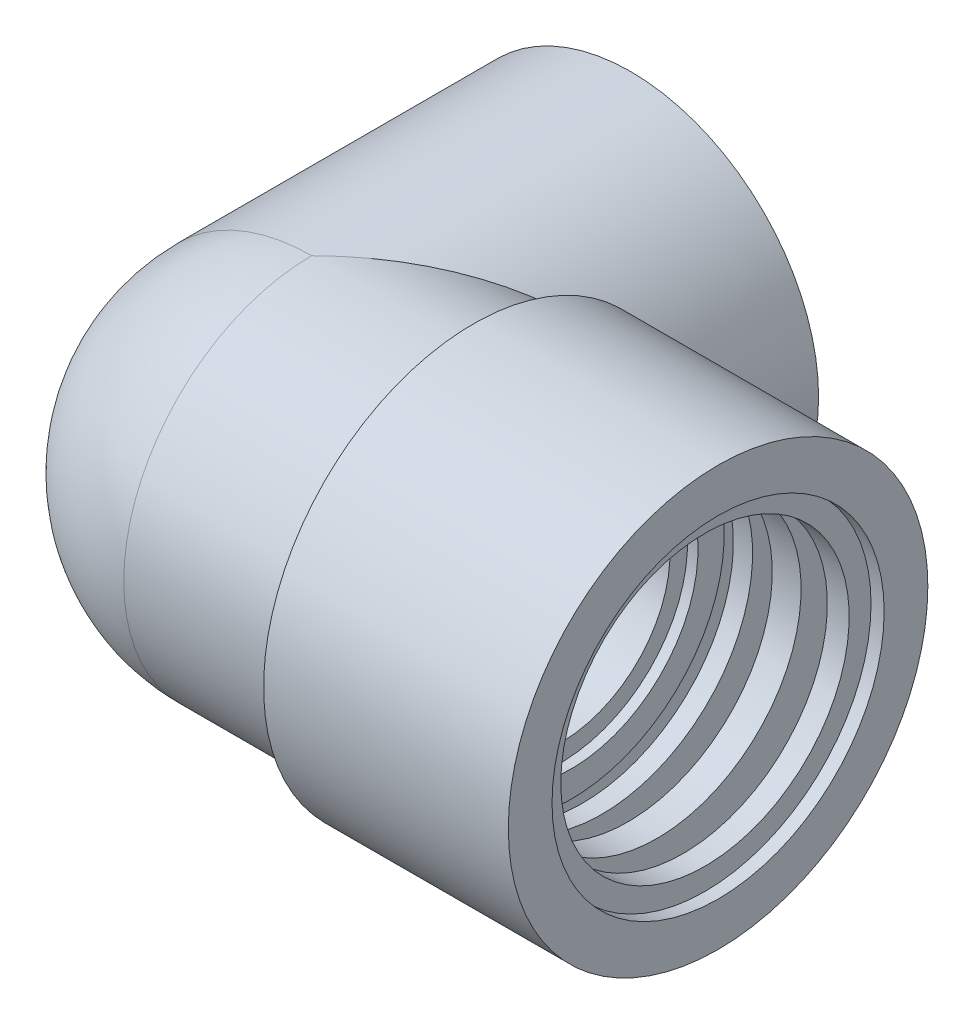
ISO-10303-21;
HEADER;
FILE_DESCRIPTION(('STEP AP214'),'2;1');
FILE_NAME('part.step','',(''),(''),'','','');
FILE_SCHEMA(('AUTOMOTIVE_DESIGN { 1 0 10303 214 1 1 1 1 }'));
ENDSEC;
DATA;
#1=APPLICATION_CONTEXT('core data for automotive mechanical design processes');
#2=APPLICATION_PROTOCOL_DEFINITION('international standard','automotive_design',2000,#1);
#3=PRODUCT_CONTEXT('',#1,'mechanical');
#4=PRODUCT('Part','Part','',(#3));
#5=PRODUCT_RELATED_PRODUCT_CATEGORY('part','',(#4));
#6=PRODUCT_DEFINITION_FORMATION('','',#4);
#7=PRODUCT_DEFINITION_CONTEXT('part definition',#1,'design');
#8=PRODUCT_DEFINITION('design','',#6,#7);
#9=PRODUCT_DEFINITION_SHAPE('','',#8);
#10=(LENGTH_UNIT() NAMED_UNIT(*) SI_UNIT(.MILLI.,.METRE.));
#11=(NAMED_UNIT(*) PLANE_ANGLE_UNIT() SI_UNIT($,.RADIAN.));
#12=(NAMED_UNIT(*) SI_UNIT($,.STERADIAN.) SOLID_ANGLE_UNIT());
#13=UNCERTAINTY_MEASURE_WITH_UNIT(LENGTH_MEASURE(1.E-05),#10,'distance_accuracy_value','');
#14=(GEOMETRIC_REPRESENTATION_CONTEXT(3) GLOBAL_UNCERTAINTY_ASSIGNED_CONTEXT((#13)) GLOBAL_UNIT_ASSIGNED_CONTEXT((#10,
#11,#12)) REPRESENTATION_CONTEXT('',''));
#15=CARTESIAN_POINT('',(0.,0.,0.));
#16=DIRECTION('',(0.,0.,1.));
#17=DIRECTION('',(1.,0.,0.));
#18=AXIS2_PLACEMENT_3D('',#15,#16,#17);
#19=CARTESIAN_POINT('',(0.,0.,0.));
#20=DIRECTION('',(0.,0.,-1.));
#21=DIRECTION('',(-1.,0.,0.));
#22=AXIS2_PLACEMENT_3D('',#19,#20,#21);
#23=PLANE('',#22);
#24=CARTESIAN_POINT('',(0.,0.,0.));
#25=DIRECTION('',(0.,0.,-1.));
#26=DIRECTION('',(1.,0.,0.));
#27=AXIS2_PLACEMENT_3D('',#24,#25,#26);
#28=CIRCLE('',#27,21.5);
#29=CARTESIAN_POINT('',(21.5,0.,0.));
#30=VERTEX_POINT('',#29);
#31=EDGE_CURVE('E124',#30,#30,#28,.T.);
#32=ORIENTED_EDGE('',*,*,#31,.T.);
#33=EDGE_LOOP('',(#32));
#34=FACE_BOUND('',#33,.T.);
#35=CARTESIAN_POINT('',(0.,0.,0.));
#36=DIRECTION('',(0.,0.,1.));
#37=DIRECTION('',(1.,0.,0.));
#38=AXIS2_PLACEMENT_3D('',#35,#36,#37);
#39=CIRCLE('',#38,15.5);
#40=CARTESIAN_POINT('',(-15.5,0.,0.));
#41=VERTEX_POINT('',#40);
#42=EDGE_CURVE('E138',#41,#41,#39,.T.);
#43=ORIENTED_EDGE('',*,*,#42,.T.);
#44=EDGE_LOOP('',(#43));
#45=FACE_BOUND('',#44,.T.);
#46=ADVANCED_FACE('F16',(#34,#45),#23,.T.);
#47=CARTESIAN_POINT('',(0.,0.,36.5));
#48=DIRECTION('',(0.,0.,-1.));
#49=DIRECTION('',(-1.,0.,0.));
#50=AXIS2_PLACEMENT_3D('',#47,#48,#49);
#51=SPHERICAL_SURFACE('',#50,21.5);
#52=CARTESIAN_POINT('',(0.,0.,36.5));
#53=DIRECTION('',(0.,0.,1.));
#54=DIRECTION('',(1.,0.,0.));
#55=AXIS2_PLACEMENT_3D('',#52,#53,#54);
#56=CIRCLE('',#55,21.5);
#57=CARTESIAN_POINT('',(0.,21.5,36.5));
#58=VERTEX_POINT('',#57);
#59=CARTESIAN_POINT('',(0.,-21.5,36.5));
#60=VERTEX_POINT('',#59);
#61=EDGE_CURVE('E153',#58,#60,#56,.T.);
#62=ORIENTED_EDGE('',*,*,#61,.T.);
#63=CARTESIAN_POINT('',(0.,0.,36.5));
#64=DIRECTION('',(-1.,0.,0.));
#65=DIRECTION('',(0.,0.,-1.));
#66=AXIS2_PLACEMENT_3D('',#63,#64,#65);
#67=CIRCLE('',#66,21.5);
#68=EDGE_CURVE('E11',#60,#58,#67,.T.);
#69=ORIENTED_EDGE('',*,*,#68,.T.);
#70=EDGE_LOOP('',(#62,#69));
#71=FACE_BOUND('',#70,.T.);
#72=ADVANCED_FACE('F233',(#71),#51,.T.);
#73=CARTESIAN_POINT('',(18.25,0.,36.5));
#74=DIRECTION('',(1.,0.,0.));
#75=DIRECTION('',(0.,0.,-1.));
#76=AXIS2_PLACEMENT_3D('',#73,#74,#75);
#77=CYLINDRICAL_SURFACE('',#76,21.5);
#78=CARTESIAN_POINT('',(18.5,0.,36.5));
#79=DIRECTION('',(-1.,0.,0.));
#80=DIRECTION('',(0.,0.,-1.));
#81=AXIS2_PLACEMENT_3D('',#78,#79,#80);
#82=CIRCLE('',#81,21.5);
#83=CARTESIAN_POINT('',(18.5,-10.9544511501033,18.));
#84=VERTEX_POINT('',#83);
#85=CARTESIAN_POINT('',(18.5,10.9544511501033,18.));
#86=VERTEX_POINT('',#85);
#87=EDGE_CURVE('E168',#84,#86,#82,.T.);
#88=ORIENTED_EDGE('',*,*,#87,.T.);
#89=CARTESIAN_POINT('',(0.,0.,36.5));
#90=DIRECTION('',(-0.707106781186548,0.,-0.707106781186547));
#91=DIRECTION('',(0.707106781186547,0.,-0.707106781186548));
#92=AXIS2_PLACEMENT_3D('',#89,#90,#91);
#93=ELLIPSE('',#92,30.4055915910216,21.5);
#94=EDGE_CURVE('E159',#58,#86,#93,.T.);
#95=ORIENTED_EDGE('',*,*,#94,.F.);
#96=ORIENTED_EDGE('',*,*,#68,.F.);
#97=CARTESIAN_POINT('',(0.,0.,36.5));
#98=DIRECTION('',(-0.707106781186548,0.,-0.707106781186547));
#99=DIRECTION('',(0.707106781186547,0.,-0.707106781186548));
#100=AXIS2_PLACEMENT_3D('',#97,#98,#99);
#101=ELLIPSE('',#100,30.4055915910216,21.5);
#102=EDGE_CURVE('E151',#84,#60,#101,.T.);
#103=ORIENTED_EDGE('',*,*,#102,.F.);
#104=EDGE_LOOP('',(#88,#95,#96,#103));
#105=FACE_BOUND('',#104,.T.);
#106=ADVANCED_FACE('F310',(#105),#77,.T.);
#107=CARTESIAN_POINT('',(0.,0.,36.5));
#108=DIRECTION('',(0.,0.,-1.));
#109=DIRECTION('',(-1.,0.,0.));
#110=AXIS2_PLACEMENT_3D('',#107,#108,#109);
#111=SPHERICAL_SURFACE('',#110,12.5);
#112=CARTESIAN_POINT('',(0.,0.,36.5));
#113=DIRECTION('',(0.,0.,1.));
#114=DIRECTION('',(1.,0.,0.));
#115=AXIS2_PLACEMENT_3D('',#112,#113,#114);
#116=CIRCLE('',#115,12.5);
#117=CARTESIAN_POINT('',(0.,12.5,36.5));
#118=VERTEX_POINT('',#117);
#119=CARTESIAN_POINT('',(0.,-12.5,36.5));
#120=VERTEX_POINT('',#119);
#121=EDGE_CURVE('E28',#118,#120,#116,.T.);
#122=ORIENTED_EDGE('',*,*,#121,.F.);
#123=CARTESIAN_POINT('',(0.,0.,36.5));
#124=DIRECTION('',(-1.,0.,0.));
#125=DIRECTION('',(0.,0.,-1.));
#126=AXIS2_PLACEMENT_3D('',#123,#124,#125);
#127=CIRCLE('',#126,12.5);
#128=EDGE_CURVE('E174',#120,#118,#127,.T.);
#129=ORIENTED_EDGE('',*,*,#128,.F.);
#130=EDGE_LOOP('',(#122,#129));
#131=FACE_BOUND('',#130,.T.);
#132=ADVANCED_FACE('F304',(#131),#111,.F.);
#133=CARTESIAN_POINT('',(0.,0.,13.25));
#134=DIRECTION('',(0.,0.,-1.));
#135=DIRECTION('',(1.,0.,0.));
#136=AXIS2_PLACEMENT_3D('',#133,#134,#135);
#137=CYLINDRICAL_SURFACE('',#136,12.5);
#138=CARTESIAN_POINT('',(0.,0.,36.5));
#139=DIRECTION('',(-0.707106781186548,0.,-0.707106781186547));
#140=DIRECTION('',(0.707106781186547,0.,-0.707106781186548));
#141=AXIS2_PLACEMENT_3D('',#138,#139,#140);
#142=ELLIPSE('',#141,17.6776695296637,12.5);
#143=EDGE_CURVE('E283',#118,#120,#142,.T.);
#144=ORIENTED_EDGE('',*,*,#143,.F.);
#145=ORIENTED_EDGE('',*,*,#121,.T.);
#146=EDGE_LOOP('',(#144,#145));
#147=FACE_BOUND('',#146,.T.);
#148=CARTESIAN_POINT('',(0.,0.,20.));
#149=DIRECTION('',(0.,0.,-1.));
#150=DIRECTION('',(1.,0.,0.));
#151=AXIS2_PLACEMENT_3D('',#148,#149,#150);
#152=CIRCLE('',#151,12.5);
#153=CARTESIAN_POINT('',(-12.5,0.,20.));
#154=VERTEX_POINT('',#153);
#155=EDGE_CURVE('E286',#154,#154,#152,.T.);
#156=ORIENTED_EDGE('',*,*,#155,.T.);
#157=EDGE_LOOP('',(#156));
#158=FACE_BOUND('',#157,.T.);
#159=ADVANCED_FACE('F195',(#147,#158),#137,.F.);
#160=CARTESIAN_POINT('',(0.,0.,18.25));
#161=DIRECTION('',(0.,0.,-1.));
#162=DIRECTION('',(1.,0.,0.));
#163=AXIS2_PLACEMENT_3D('',#160,#161,#162);
#164=CYLINDRICAL_SURFACE('',#163,21.5);
#165=DIRECTION('',(0.,0.,-1.));
#166=VECTOR('',#165,1.);
#167=CARTESIAN_POINT('',(18.5,10.9544511501033,24.5));
#168=LINE('',#167,#166);
#169=CARTESIAN_POINT('',(18.5,10.9544511501033,15.1458434959374));
#170=VERTEX_POINT('',#169);
#171=EDGE_CURVE('E171',#86,#170,#168,.T.);
#172=ORIENTED_EDGE('',*,*,#171,.T.);
#173=CARTESIAN_POINT('',(18.5000022060146,10.9544474245602,15.1458533034375));
#174=CARTESIAN_POINT('',(18.6208089033243,10.7504294226377,15.0411917160868));
#175=CARTESIAN_POINT('',(18.7387487661129,10.5435513707551,14.9387700341873));
#176=CARTESIAN_POINT('',(18.966427645106,10.1281610050711,14.7406202531294));
#177=CARTESIAN_POINT('',(19.0762794779684,9.91975335140551,14.6448022690424));
#178=CARTESIAN_POINT('',(19.2878861524351,9.50164760975378,14.4598564268788));
#179=CARTESIAN_POINT('',(19.3897545456631,9.29204779707309,14.3706365403204));
#180=CARTESIAN_POINT('',(19.5855090048439,8.87189589426892,14.1988923539008));
#181=CARTESIAN_POINT('',(19.6795089548388,8.66143540716794,14.1162738552085));
#182=CARTESIAN_POINT('',(19.865232733022,8.22682981566922,13.9528174801884));
#183=CARTESIAN_POINT('',(19.9566877417656,8.00248420855006,13.8722064796304));
#184=CARTESIAN_POINT('',(20.1313107914595,7.55233453401997,13.7180683110048));
#185=CARTESIAN_POINT('',(20.2145800889183,7.32659924192242,13.6444551030307));
#186=CARTESIAN_POINT('',(20.3728973279529,6.87398837529713,13.5043129972414));
#187=CARTESIAN_POINT('',(20.4480450120638,6.64717423932388,13.4376985249077));
#188=CARTESIAN_POINT('',(20.5901954005636,6.19271807551264,13.3115547161796));
#189=CARTESIAN_POINT('',(20.6572957291995,5.96513012560332,13.2519406931406));
#190=CARTESIAN_POINT('',(20.7856000387341,5.50162245483875,13.1378692866962));
#191=CARTESIAN_POINT('',(20.8466523404376,5.26562789743605,13.083544957092));
#192=CARTESIAN_POINT('',(20.9604377660656,4.79256389974456,12.9822127214425));
#193=CARTESIAN_POINT('',(21.0132445034482,4.5555260402414,12.935140132055));
#194=CARTESIAN_POINT('',(21.1105737981786,4.08067314219163,12.8483096283194));
#195=CARTESIAN_POINT('',(21.155165282646,3.84288337694732,12.8084908881059));
#196=CARTESIAN_POINT('',(21.2361093203606,3.36682128907516,12.7361623332685));
#197=CARTESIAN_POINT('',(21.2725255130783,3.12856837851594,12.7035960797696));
#198=CARTESIAN_POINT('',(21.3374271222396,2.65000726154572,12.6455472232995));
#199=CARTESIAN_POINT('',(21.3659087347469,2.40969812606099,12.6200680179562));
#200=CARTESIAN_POINT('',(21.4146924057411,1.92852350430201,12.5764163427741));
#201=CARTESIAN_POINT('',(21.4350252606349,1.68766363980116,12.5582163632668));
#202=CARTESIAN_POINT('',(21.4675229016468,1.2056669135373,12.5291157694208));
#203=CARTESIAN_POINT('',(21.4797115229378,0.964532947369313,12.5181938551219));
#204=CARTESIAN_POINT('',(21.4959417593156,0.482265313888855,12.5036433767132));
#205=CARTESIAN_POINT('',(21.4999999999759,0.241132656332783,12.4999999291273));
#206=CARTESIAN_POINT('',(21.5000000000241,-0.241126714065594,12.5000000708709));
#207=CARTESIAN_POINT('',(21.495941959425,-0.48225342690796,12.5036434806271));
#208=CARTESIAN_POINT('',(21.4797123893944,-0.96451315411499,12.5181938708184));
#209=CARTESIAN_POINT('',(21.4675241014417,-1.20564515064792,12.5291158542124));
#210=CARTESIAN_POINT('',(21.4350269945235,-1.68764190244222,12.5582165163491));
#211=CARTESIAN_POINT('',(21.4146942080788,-1.92850374606644,12.5764166127226));
#212=CARTESIAN_POINT('',(21.365910134749,-2.4096863057008,12.6200680999982));
#213=CARTESIAN_POINT('',(21.3374279203534,-2.65000137641671,12.6455471142006));
#214=CARTESIAN_POINT('',(21.2725271188028,-3.1285565386061,12.7035940391779));
#215=CARTESIAN_POINT('',(21.2361129244453,-3.36679770297925,12.7361580262232));
#216=CARTESIAN_POINT('',(21.1551723396268,-3.84284428052881,12.8084835272388));
#217=CARTESIAN_POINT('',(21.1105820526493,-4.08063020220183,12.8483017161553));
#218=CARTESIAN_POINT('',(21.0132538157496,-4.55548329831242,12.935132322011));
#219=CARTESIAN_POINT('',(20.9604466833488,-4.7925251058351,12.9822057902033));
#220=CARTESIAN_POINT('',(20.8466583147484,-5.26560479571435,13.0835406700491));
#221=CARTESIAN_POINT('',(20.7856032120555,-5.50161099112959,13.137866977438));
#222=CARTESIAN_POINT('',(20.6572988921322,-5.96511869918434,13.2519373795138));
#223=CARTESIAN_POINT('',(20.5902020819983,-6.19269540712746,13.3115477816833));
#224=CARTESIAN_POINT('',(20.4480571290523,-6.64713682701105,13.4376867622019));
#225=CARTESIAN_POINT('',(20.3729111309303,-6.87394732956935,13.5043002413638));
#226=CARTESIAN_POINT('',(20.2145948950362,-7.32655852006549,13.6444424388162));
#227=CARTESIAN_POINT('',(20.1313246849673,-7.55229762814218,13.718056928286));
#228=CARTESIAN_POINT('',(19.9566966624093,-8.00246231924776,13.8721995598635));
#229=CARTESIAN_POINT('',(19.8652373651458,-8.22681897672192,13.9528139228923));
#230=CARTESIAN_POINT('',(19.6795113705213,-8.66142975381635,14.1162712310182));
#231=CARTESIAN_POINT('',(19.5855139848758,-8.87188473971687,14.1988868925354));
#232=CARTESIAN_POINT('',(19.3897633073151,-9.29202946643542,14.3706273393489));
#233=CARTESIAN_POINT('',(19.2878960270025,-9.50162751482494,14.4598464240173));
#234=CARTESIAN_POINT('',(19.0762898331279,-9.91973348632241,14.644792307483));
#235=CARTESIAN_POINT('',(18.9664372626993,-10.1281430421867,14.7406112221459));
#236=CARTESIAN_POINT('',(18.7387548144299,-10.5435407599104,14.9387645870345));
#237=CARTESIAN_POINT('',(18.6208120148567,-10.7504241651798,15.0411890040473));
#238=CARTESIAN_POINT('',(18.5000022060147,-10.9544474245601,15.1458533034375));
#239=B_SPLINE_CURVE_WITH_KNOTS('',3,(#173,#174,#175,#176,#177,#178,#179,#180,#181,#182,#183,
#184,#185,#186,#187,#188,#189,#190,#191,#192,#193,#194,#195,#196,#197,#198,#199,#200,#201,#202,
#203,#204,#205,#206,#207,#208,#209,#210,#211,#212,#213,#214,#215,#216,#217,#218,#219,#220,#221,
#222,#223,#224,#225,#226,#227,#228,#229,#230,#231,#232,#233,#234,#235,#236,#237,#238),
.UNSPECIFIED.,.F.,.F.,(4,2,2,2,2,2,2,2,2,2,2,2,2,2,2,2,2,2,2,2,2,2,2,2,2,2,2,2,2,2,2,2,4),(0.,
0.777498628019535,1.54031292358065,2.28875662018293,3.02316186957841,3.78894331673818,
4.54357687405406,5.28752171863321,6.02125709535245,6.77025457971178,7.51212704139954,
8.24745935461006,8.9768521266914,9.70659397931693,10.4335513227196,11.1583717005917,
11.8817083957967,12.6050272657096,13.3298417072063,14.0568049762878,14.7865645583035,
15.5159210161846,16.2512412144758,16.9931257912889,17.7421595932503,18.4758580706921,
19.2197906071422,19.9744364729076,20.7402548242082,21.4746400699904,22.2230770899888,
22.985898067653,23.7634167497717),.UNSPECIFIED.);
#240=CARTESIAN_POINT('',(18.5,-10.9544511501033,15.1458434959374));
#241=VERTEX_POINT('',#240);
#242=EDGE_CURVE('E125',#170,#241,#239,.T.);
#243=ORIENTED_EDGE('',*,*,#242,.T.);
#244=DIRECTION('',(0.,0.,1.));
#245=VECTOR('',#244,1.);
#246=CARTESIAN_POINT('',(18.5,-10.9544511501033,24.5));
#247=LINE('',#246,#245);
#248=EDGE_CURVE('E163',#241,#84,#247,.T.);
#249=ORIENTED_EDGE('',*,*,#248,.T.);
#250=ORIENTED_EDGE('',*,*,#102,.T.);
#251=ORIENTED_EDGE('',*,*,#61,.F.);
#252=ORIENTED_EDGE('',*,*,#94,.T.);
#253=EDGE_LOOP('',(#172,#243,#249,#250,#251,#252));
#254=FACE_BOUND('',#253,.T.);
#255=ORIENTED_EDGE('',*,*,#31,.F.);
#256=EDGE_LOOP('',(#255));
#257=FACE_BOUND('',#256,.T.);
#258=ADVANCED_FACE('F184',(#254,#257),#164,.T.);
#259=CARTESIAN_POINT('',(46.5,0.,36.5));
#260=DIRECTION('',(1.,0.,0.));
#261=DIRECTION('',(0.,0.,-1.));
#262=AXIS2_PLACEMENT_3D('',#259,#260,#261);
#263=PLANE('',#262);
#264=CARTESIAN_POINT('',(46.5,0.,36.5));
#265=DIRECTION('',(1.,0.,0.));
#266=DIRECTION('',(0.,0.,-1.));
#267=AXIS2_PLACEMENT_3D('',#264,#265,#266);
#268=CIRCLE('',#267,24.);
#269=CARTESIAN_POINT('',(46.5,0.,12.5));
#270=VERTEX_POINT('',#269);
#271=EDGE_CURVE('E121',#270,#270,#268,.T.);
#272=ORIENTED_EDGE('',*,*,#271,.T.);
#273=EDGE_LOOP('',(#272));
#274=FACE_BOUND('',#273,.T.);
#275=CARTESIAN_POINT('',(46.5,0.,36.5));
#276=DIRECTION('',(-1.,0.,0.));
#277=DIRECTION('',(0.,0.,1.));
#278=AXIS2_PLACEMENT_3D('',#275,#276,#277);
#279=CIRCLE('',#278,19.);
#280=CARTESIAN_POINT('',(46.5,0.,55.5));
#281=VERTEX_POINT('',#280);
#282=EDGE_CURVE('E116',#281,#281,#279,.T.);
#283=ORIENTED_EDGE('',*,*,#282,.T.);
#284=EDGE_LOOP('',(#283));
#285=FACE_BOUND('',#284,.T.);
#286=ADVANCED_FACE('F194',(#274,#285),#263,.T.);
#287=CARTESIAN_POINT('',(32.5,0.,36.5));
#288=DIRECTION('',(-1.,0.,0.));
#289=DIRECTION('',(0.,0.,-1.));
#290=AXIS2_PLACEMENT_3D('',#287,#288,#289);
#291=CYLINDRICAL_SURFACE('',#290,24.);
#292=ORIENTED_EDGE('',*,*,#271,.F.);
#293=EDGE_LOOP('',(#292));
#294=FACE_BOUND('',#293,.T.);
#295=ORIENTED_EDGE('',*,*,#242,.F.);
#296=CARTESIAN_POINT('',(18.5,0.,36.5));
#297=DIRECTION('',(-1.,0.,0.));
#298=DIRECTION('',(0.,0.,-1.));
#299=AXIS2_PLACEMENT_3D('',#296,#297,#298);
#300=CIRCLE('',#299,24.);
#301=EDGE_CURVE('E160',#241,#170,#300,.T.);
#302=ORIENTED_EDGE('',*,*,#301,.F.);
#303=EDGE_LOOP('',(#295,#302));
#304=FACE_BOUND('',#303,.T.);
#305=ADVANCED_FACE('F255',(#294,#304),#291,.T.);
#306=CARTESIAN_POINT('',(18.5,0.,36.5));
#307=DIRECTION('',(-1.,0.,0.));
#308=DIRECTION('',(0.,0.,1.));
#309=AXIS2_PLACEMENT_3D('',#306,#307,#308);
#310=PLANE('',#309);
#311=ORIENTED_EDGE('',*,*,#171,.F.);
#312=ORIENTED_EDGE('',*,*,#87,.F.);
#313=ORIENTED_EDGE('',*,*,#248,.F.);
#314=ORIENTED_EDGE('',*,*,#301,.T.);
#315=EDGE_LOOP('',(#311,#312,#313,#314));
#316=FACE_BOUND('',#315,.T.);
#317=ADVANCED_FACE('F18',(#316),#310,.T.);
#318=CARTESIAN_POINT('',(23.25,0.,36.5));
#319=DIRECTION('',(1.,0.,0.));
#320=DIRECTION('',(0.,0.,-1.));
#321=AXIS2_PLACEMENT_3D('',#318,#319,#320);
#322=CYLINDRICAL_SURFACE('',#321,12.5);
#323=ORIENTED_EDGE('',*,*,#143,.T.);
#324=ORIENTED_EDGE('',*,*,#128,.T.);
#325=EDGE_LOOP('',(#323,#324));
#326=FACE_BOUND('',#325,.T.);
#327=CARTESIAN_POINT('',(28.5,0.,36.5));
#328=DIRECTION('',(1.,0.,0.));
#329=DIRECTION('',(0.,0.,-1.));
#330=AXIS2_PLACEMENT_3D('',#327,#328,#329);
#331=CIRCLE('',#330,12.5);
#332=CARTESIAN_POINT('',(28.5,0.,49.));
#333=VERTEX_POINT('',#332);
#334=EDGE_CURVE('E155',#333,#333,#331,.T.);
#335=ORIENTED_EDGE('',*,*,#334,.T.);
#336=EDGE_LOOP('',(#335));
#337=FACE_BOUND('',#336,.T.);
#338=ADVANCED_FACE('F251',(#326,#337),#322,.F.);
#339=CARTESIAN_POINT('',(0.,0.,20.));
#340=DIRECTION('',(0.,0.,1.));
#341=DIRECTION('',(1.,0.,0.));
#342=AXIS2_PLACEMENT_3D('',#339,#340,#341);
#343=PLANE('',#342);
#344=CARTESIAN_POINT('',(0.,0.,20.));
#345=DIRECTION('',(0.,0.,1.));
#346=DIRECTION('',(1.,0.,0.));
#347=AXIS2_PLACEMENT_3D('',#344,#345,#346);
#348=CIRCLE('',#347,15.5);
#349=CARTESIAN_POINT('',(15.5,0.,20.));
#350=VERTEX_POINT('',#349);
#351=EDGE_CURVE('E139',#350,#350,#348,.T.);
#352=ORIENTED_EDGE('',*,*,#351,.F.);
#353=EDGE_LOOP('',(#352));
#354=FACE_BOUND('',#353,.T.);
#355=ORIENTED_EDGE('',*,*,#155,.F.);
#356=EDGE_LOOP('',(#355));
#357=FACE_BOUND('',#356,.T.);
#358=ADVANCED_FACE('F243',(#354,#357),#343,.F.);
#359=CARTESIAN_POINT('',(0.,0.,7.5));
#360=DIRECTION('',(0.,0.,-1.));
#361=DIRECTION('',(1.,0.,0.));
#362=AXIS2_PLACEMENT_3D('',#359,#360,#361);
#363=CYLINDRICAL_SURFACE('',#362,15.5);
#364=ORIENTED_EDGE('',*,*,#351,.T.);
#365=EDGE_LOOP('',(#364));
#366=FACE_BOUND('',#365,.T.);
#367=ORIENTED_EDGE('',*,*,#42,.F.);
#368=EDGE_LOOP('',(#367));
#369=FACE_BOUND('',#368,.T.);
#370=ADVANCED_FACE('F217',(#366,#369),#363,.F.);
#371=CARTESIAN_POINT('',(45.75,0.,36.5));
#372=DIRECTION('',(-1.,0.,0.));
#373=DIRECTION('',(0.,0.,1.));
#374=AXIS2_PLACEMENT_3D('',#371,#372,#373);
#375=CYLINDRICAL_SURFACE('',#374,19.);
#376=CARTESIAN_POINT('',(45.,0.,36.5));
#377=DIRECTION('',(1.,0.,0.));
#378=DIRECTION('',(0.,0.,1.));
#379=AXIS2_PLACEMENT_3D('',#376,#377,#378);
#380=CIRCLE('',#379,19.);
#381=CARTESIAN_POINT('',(45.,0.,55.5));
#382=VERTEX_POINT('',#381);
#383=EDGE_CURVE('E118',#382,#382,#380,.T.);
#384=ORIENTED_EDGE('',*,*,#383,.F.);
#385=EDGE_LOOP('',(#384));
#386=FACE_BOUND('',#385,.T.);
#387=ORIENTED_EDGE('',*,*,#282,.F.);
#388=EDGE_LOOP('',(#387));
#389=FACE_BOUND('',#388,.T.);
#390=ADVANCED_FACE('F213',(#386,#389),#375,.F.);
#391=CARTESIAN_POINT('',(45.,0.,54.25));
#392=DIRECTION('',(-1.,0.,0.));
#393=DIRECTION('',(0.,0.,-1.));
#394=AXIS2_PLACEMENT_3D('',#391,#392,#393);
#395=PLANE('',#394);
#396=CARTESIAN_POINT('',(45.,0.,36.5));
#397=DIRECTION('',(1.,0.,0.));
#398=DIRECTION('',(0.,0.,1.));
#399=AXIS2_PLACEMENT_3D('',#396,#397,#398);
#400=CIRCLE('',#399,16.5);
#401=CARTESIAN_POINT('',(45.,0.,53.));
#402=VERTEX_POINT('',#401);
#403=EDGE_CURVE('E120',#402,#402,#400,.T.);
#404=ORIENTED_EDGE('',*,*,#403,.F.);
#405=EDGE_LOOP('',(#404));
#406=FACE_BOUND('',#405,.T.);
#407=ORIENTED_EDGE('',*,*,#383,.T.);
#408=EDGE_LOOP('',(#407));
#409=FACE_BOUND('',#408,.T.);
#410=ADVANCED_FACE('F216',(#406,#409),#395,.F.);
#411=CARTESIAN_POINT('',(43.75,0.,36.5));
#412=DIRECTION('',(-1.,0.,0.));
#413=DIRECTION('',(0.,0.,1.));
#414=AXIS2_PLACEMENT_3D('',#411,#412,#413);
#415=CYLINDRICAL_SURFACE('',#414,16.5);
#416=CARTESIAN_POINT('',(42.5,0.,36.5));
#417=DIRECTION('',(1.,0.,0.));
#418=DIRECTION('',(0.,0.,1.));
#419=AXIS2_PLACEMENT_3D('',#416,#417,#418);
#420=CIRCLE('',#419,16.5);
#421=CARTESIAN_POINT('',(42.5,0.,53.));
#422=VERTEX_POINT('',#421);
#423=EDGE_CURVE('E128',#422,#422,#420,.T.);
#424=ORIENTED_EDGE('',*,*,#423,.F.);
#425=EDGE_LOOP('',(#424));
#426=FACE_BOUND('',#425,.T.);
#427=ORIENTED_EDGE('',*,*,#403,.T.);
#428=EDGE_LOOP('',(#427));
#429=FACE_BOUND('',#428,.T.);
#430=ADVANCED_FACE('F239',(#426,#429),#415,.F.);
#431=CARTESIAN_POINT('',(42.5,0.,55.5));
#432=DIRECTION('',(1.,0.,0.));
#433=DIRECTION('',(0.,0.,1.));
#434=AXIS2_PLACEMENT_3D('',#431,#432,#433);
#435=PLANE('',#434);
#436=CARTESIAN_POINT('',(42.5,0.,36.5));
#437=DIRECTION('',(1.,0.,0.));
#438=DIRECTION('',(0.,0.,1.));
#439=AXIS2_PLACEMENT_3D('',#436,#437,#438);
#440=CIRCLE('',#439,21.5);
#441=CARTESIAN_POINT('',(42.5,0.,58.));
#442=VERTEX_POINT('',#441);
#443=EDGE_CURVE('E126',#442,#442,#440,.T.);
#444=ORIENTED_EDGE('',*,*,#443,.F.);
#445=EDGE_LOOP('',(#444));
#446=FACE_BOUND('',#445,.T.);
#447=ORIENTED_EDGE('',*,*,#423,.T.);
#448=EDGE_LOOP('',(#447));
#449=FACE_BOUND('',#448,.T.);
#450=ADVANCED_FACE('F235',(#446,#449),#435,.F.);
#451=CARTESIAN_POINT('',(41.,0.,36.5));
#452=DIRECTION('',(-1.,0.,0.));
#453=DIRECTION('',(0.,0.,1.));
#454=AXIS2_PLACEMENT_3D('',#451,#452,#453);
#455=CYLINDRICAL_SURFACE('',#454,21.5);
#456=CARTESIAN_POINT('',(39.5,0.,36.5));
#457=DIRECTION('',(1.,0.,0.));
#458=DIRECTION('',(0.,0.,1.));
#459=AXIS2_PLACEMENT_3D('',#456,#457,#458);
#460=CIRCLE('',#459,21.5);
#461=CARTESIAN_POINT('',(39.5,0.,58.));
#462=VERTEX_POINT('',#461);
#463=EDGE_CURVE('E129',#462,#462,#460,.T.);
#464=ORIENTED_EDGE('',*,*,#463,.F.);
#465=EDGE_LOOP('',(#464));
#466=FACE_BOUND('',#465,.T.);
#467=ORIENTED_EDGE('',*,*,#443,.T.);
#468=EDGE_LOOP('',(#467));
#469=FACE_BOUND('',#468,.T.);
#470=ADVANCED_FACE('F238',(#466,#469),#455,.F.);
#471=CARTESIAN_POINT('',(39.5,0.,55.5));
#472=DIRECTION('',(-1.,0.,0.));
#473=DIRECTION('',(0.,0.,-1.));
#474=AXIS2_PLACEMENT_3D('',#471,#472,#473);
#475=PLANE('',#474);
#476=CARTESIAN_POINT('',(39.5,0.,36.5));
#477=DIRECTION('',(1.,0.,0.));
#478=DIRECTION('',(0.,0.,1.));
#479=AXIS2_PLACEMENT_3D('',#476,#477,#478);
#480=CIRCLE('',#479,16.5);
#481=CARTESIAN_POINT('',(39.5,0.,53.));
#482=VERTEX_POINT('',#481);
#483=EDGE_CURVE('E136',#482,#482,#480,.T.);
#484=ORIENTED_EDGE('',*,*,#483,.F.);
#485=EDGE_LOOP('',(#484));
#486=FACE_BOUND('',#485,.T.);
#487=ORIENTED_EDGE('',*,*,#463,.T.);
#488=EDGE_LOOP('',(#487));
#489=FACE_BOUND('',#488,.T.);
#490=ADVANCED_FACE('F245',(#486,#489),#475,.F.);
#491=CARTESIAN_POINT('',(37.85,0.,36.5));
#492=DIRECTION('',(-1.,0.,0.));
#493=DIRECTION('',(0.,0.,1.));
#494=AXIS2_PLACEMENT_3D('',#491,#492,#493);
#495=CYLINDRICAL_SURFACE('',#494,16.5);
#496=CARTESIAN_POINT('',(36.2,0.,36.5));
#497=DIRECTION('',(1.,0.,0.));
#498=DIRECTION('',(0.,0.,1.));
#499=AXIS2_PLACEMENT_3D('',#496,#497,#498);
#500=CIRCLE('',#499,16.5);
#501=CARTESIAN_POINT('',(36.2,0.,53.));
#502=VERTEX_POINT('',#501);
#503=EDGE_CURVE('E134',#502,#502,#500,.T.);
#504=ORIENTED_EDGE('',*,*,#503,.F.);
#505=EDGE_LOOP('',(#504));
#506=FACE_BOUND('',#505,.T.);
#507=ORIENTED_EDGE('',*,*,#483,.T.);
#508=EDGE_LOOP('',(#507));
#509=FACE_BOUND('',#508,.T.);
#510=ADVANCED_FACE('F229',(#506,#509),#495,.F.);
#511=CARTESIAN_POINT('',(36.2,0.,55.5));
#512=DIRECTION('',(1.,0.,0.));
#513=DIRECTION('',(0.,0.,1.));
#514=AXIS2_PLACEMENT_3D('',#511,#512,#513);
#515=PLANE('',#514);
#516=CARTESIAN_POINT('',(36.2,0.,36.5));
#517=DIRECTION('',(1.,0.,0.));
#518=DIRECTION('',(0.,0.,1.));
#519=AXIS2_PLACEMENT_3D('',#516,#517,#518);
#520=CIRCLE('',#519,21.5);
#521=CARTESIAN_POINT('',(36.2,0.,58.));
#522=VERTEX_POINT('',#521);
#523=EDGE_CURVE('E133',#522,#522,#520,.T.);
#524=ORIENTED_EDGE('',*,*,#523,.F.);
#525=EDGE_LOOP('',(#524));
#526=FACE_BOUND('',#525,.T.);
#527=ORIENTED_EDGE('',*,*,#503,.T.);
#528=EDGE_LOOP('',(#527));
#529=FACE_BOUND('',#528,.T.);
#530=ADVANCED_FACE('F211',(#526,#529),#515,.F.);
#531=CARTESIAN_POINT('',(34.7,0.,36.5));
#532=DIRECTION('',(-1.,0.,0.));
#533=DIRECTION('',(0.,0.,1.));
#534=AXIS2_PLACEMENT_3D('',#531,#532,#533);
#535=CYLINDRICAL_SURFACE('',#534,21.5);
#536=CARTESIAN_POINT('',(33.2,0.,36.5));
#537=DIRECTION('',(1.,0.,0.));
#538=DIRECTION('',(0.,0.,1.));
#539=AXIS2_PLACEMENT_3D('',#536,#537,#538);
#540=CIRCLE('',#539,21.5);
#541=CARTESIAN_POINT('',(33.2,0.,58.));
#542=VERTEX_POINT('',#541);
#543=EDGE_CURVE('E130',#542,#542,#540,.T.);
#544=ORIENTED_EDGE('',*,*,#543,.F.);
#545=EDGE_LOOP('',(#544));
#546=FACE_BOUND('',#545,.T.);
#547=ORIENTED_EDGE('',*,*,#523,.T.);
#548=EDGE_LOOP('',(#547));
#549=FACE_BOUND('',#548,.T.);
#550=ADVANCED_FACE('F207',(#546,#549),#535,.F.);
#551=CARTESIAN_POINT('',(33.2,0.,55.875));
#552=DIRECTION('',(-1.,0.,0.));
#553=DIRECTION('',(0.,0.,-1.));
#554=AXIS2_PLACEMENT_3D('',#551,#552,#553);
#555=PLANE('',#554);
#556=CARTESIAN_POINT('',(33.2,0.,36.5));
#557=DIRECTION('',(1.,0.,0.));
#558=DIRECTION('',(0.,0.,1.));
#559=AXIS2_PLACEMENT_3D('',#556,#557,#558);
#560=CIRCLE('',#559,17.25);
#561=CARTESIAN_POINT('',(33.2,0.,53.75));
#562=VERTEX_POINT('',#561);
#563=EDGE_CURVE('E110',#562,#562,#560,.T.);
#564=ORIENTED_EDGE('',*,*,#563,.F.);
#565=EDGE_LOOP('',(#564));
#566=FACE_BOUND('',#565,.T.);
#567=ORIENTED_EDGE('',*,*,#543,.T.);
#568=EDGE_LOOP('',(#567));
#569=FACE_BOUND('',#568,.T.);
#570=ADVANCED_FACE('F210',(#566,#569),#555,.F.);
#571=CARTESIAN_POINT('',(32.1,0.,36.5));
#572=DIRECTION('',(-1.,0.,0.));
#573=DIRECTION('',(0.,0.,1.));
#574=AXIS2_PLACEMENT_3D('',#571,#572,#573);
#575=CYLINDRICAL_SURFACE('',#574,17.25);
#576=CARTESIAN_POINT('',(31.,0.,36.5));
#577=DIRECTION('',(1.,0.,0.));
#578=DIRECTION('',(0.,0.,1.));
#579=AXIS2_PLACEMENT_3D('',#576,#577,#578);
#580=CIRCLE('',#579,17.25);
#581=CARTESIAN_POINT('',(31.,0.,53.75));
#582=VERTEX_POINT('',#581);
#583=EDGE_CURVE('E107',#582,#582,#580,.T.);
#584=ORIENTED_EDGE('',*,*,#583,.F.);
#585=EDGE_LOOP('',(#584));
#586=FACE_BOUND('',#585,.T.);
#587=ORIENTED_EDGE('',*,*,#563,.T.);
#588=EDGE_LOOP('',(#587));
#589=FACE_BOUND('',#588,.T.);
#590=ADVANCED_FACE('F362',(#586,#589),#575,.F.);
#591=CARTESIAN_POINT('',(31.,0.,55.875));
#592=DIRECTION('',(1.,0.,0.));
#593=DIRECTION('',(0.,0.,1.));
#594=AXIS2_PLACEMENT_3D('',#591,#592,#593);
#595=PLANE('',#594);
#596=CARTESIAN_POINT('',(31.,0.,36.5));
#597=DIRECTION('',(1.,0.,0.));
#598=DIRECTION('',(0.,0.,1.));
#599=AXIS2_PLACEMENT_3D('',#596,#597,#598);
#600=CIRCLE('',#599,21.5);
#601=CARTESIAN_POINT('',(31.,0.,58.));
#602=VERTEX_POINT('',#601);
#603=EDGE_CURVE('E104',#602,#602,#600,.T.);
#604=ORIENTED_EDGE('',*,*,#603,.F.);
#605=EDGE_LOOP('',(#604));
#606=FACE_BOUND('',#605,.T.);
#607=ORIENTED_EDGE('',*,*,#583,.T.);
#608=EDGE_LOOP('',(#607));
#609=FACE_BOUND('',#608,.T.);
#610=ADVANCED_FACE('F196',(#606,#609),#595,.F.);
#611=CARTESIAN_POINT('',(29.75,0.,36.5));
#612=DIRECTION('',(-1.,0.,0.));
#613=DIRECTION('',(0.,0.,1.));
#614=AXIS2_PLACEMENT_3D('',#611,#612,#613);
#615=CYLINDRICAL_SURFACE('',#614,21.5);
#616=CARTESIAN_POINT('',(28.5,0.,36.5));
#617=DIRECTION('',(1.,0.,0.));
#618=DIRECTION('',(0.,0.,1.));
#619=AXIS2_PLACEMENT_3D('',#616,#617,#618);
#620=CIRCLE('',#619,21.5);
#621=CARTESIAN_POINT('',(28.5,0.,58.));
#622=VERTEX_POINT('',#621);
#623=EDGE_CURVE('E108',#622,#622,#620,.T.);
#624=ORIENTED_EDGE('',*,*,#623,.F.);
#625=EDGE_LOOP('',(#624));
#626=FACE_BOUND('',#625,.T.);
#627=ORIENTED_EDGE('',*,*,#603,.T.);
#628=EDGE_LOOP('',(#627));
#629=FACE_BOUND('',#628,.T.);
#630=ADVANCED_FACE('F105',(#626,#629),#615,.F.);
#631=CARTESIAN_POINT('',(28.5,0.,56.));
#632=DIRECTION('',(-1.,0.,0.));
#633=DIRECTION('',(0.,0.,-1.));
#634=AXIS2_PLACEMENT_3D('',#631,#632,#633);
#635=PLANE('',#634);
#636=CARTESIAN_POINT('',(28.5,0.,36.5));
#637=DIRECTION('',(1.,0.,0.));
#638=DIRECTION('',(0.,0.,1.));
#639=AXIS2_PLACEMENT_3D('',#636,#637,#638);
#640=CIRCLE('',#639,17.5);
#641=CARTESIAN_POINT('',(28.5,0.,54.));
#642=VERTEX_POINT('',#641);
#643=EDGE_CURVE('E112',#642,#642,#640,.T.);
#644=ORIENTED_EDGE('',*,*,#643,.F.);
#645=EDGE_LOOP('',(#644));
#646=FACE_BOUND('',#645,.T.);
#647=ORIENTED_EDGE('',*,*,#623,.T.);
#648=EDGE_LOOP('',(#647));
#649=FACE_BOUND('',#648,.T.);
#650=ADVANCED_FACE('F200',(#646,#649),#635,.F.);
#651=CARTESIAN_POINT('',(29.1,0.,36.5));
#652=DIRECTION('',(-1.,0.,0.));
#653=DIRECTION('',(0.,0.,1.));
#654=AXIS2_PLACEMENT_3D('',#651,#652,#653);
#655=CYLINDRICAL_SURFACE('',#654,17.5);
#656=CARTESIAN_POINT('',(29.7,0.,36.5));
#657=DIRECTION('',(1.,0.,0.));
#658=DIRECTION('',(0.,0.,1.));
#659=AXIS2_PLACEMENT_3D('',#656,#657,#658);
#660=CIRCLE('',#659,17.5);
#661=CARTESIAN_POINT('',(29.7,0.,54.));
#662=VERTEX_POINT('',#661);
#663=EDGE_CURVE('E147',#662,#662,#660,.T.);
#664=ORIENTED_EDGE('',*,*,#663,.F.);
#665=EDGE_LOOP('',(#664));
#666=FACE_BOUND('',#665,.T.);
#667=ORIENTED_EDGE('',*,*,#643,.T.);
#668=EDGE_LOOP('',(#667));
#669=FACE_BOUND('',#668,.T.);
#670=ADVANCED_FACE('F221',(#666,#669),#655,.T.);
#671=CARTESIAN_POINT('',(29.7,0.,52.5));
#672=DIRECTION('',(-1.,0.,0.));
#673=DIRECTION('',(0.,0.,-1.));
#674=AXIS2_PLACEMENT_3D('',#671,#672,#673);
#675=PLANE('',#674);
#676=CARTESIAN_POINT('',(29.7,0.,36.5));
#677=DIRECTION('',(1.,0.,0.));
#678=DIRECTION('',(0.,0.,1.));
#679=AXIS2_PLACEMENT_3D('',#676,#677,#678);
#680=CIRCLE('',#679,14.5);
#681=CARTESIAN_POINT('',(29.7,0.,51.));
#682=VERTEX_POINT('',#681);
#683=EDGE_CURVE('E144',#682,#682,#680,.T.);
#684=ORIENTED_EDGE('',*,*,#683,.F.);
#685=EDGE_LOOP('',(#684));
#686=FACE_BOUND('',#685,.T.);
#687=ORIENTED_EDGE('',*,*,#663,.T.);
#688=EDGE_LOOP('',(#687));
#689=FACE_BOUND('',#688,.T.);
#690=ADVANCED_FACE('F225',(#686,#689),#675,.F.);
#691=CARTESIAN_POINT('',(29.1,0.,36.5));
#692=DIRECTION('',(-1.,0.,0.));
#693=DIRECTION('',(0.,0.,1.));
#694=AXIS2_PLACEMENT_3D('',#691,#692,#693);
#695=CYLINDRICAL_SURFACE('',#694,14.5);
#696=CARTESIAN_POINT('',(28.5,0.,36.5));
#697=DIRECTION('',(1.,0.,0.));
#698=DIRECTION('',(0.,0.,1.));
#699=AXIS2_PLACEMENT_3D('',#696,#697,#698);
#700=CIRCLE('',#699,14.5);
#701=CARTESIAN_POINT('',(28.5,0.,51.));
#702=VERTEX_POINT('',#701);
#703=EDGE_CURVE('E148',#702,#702,#700,.T.);
#704=ORIENTED_EDGE('',*,*,#703,.F.);
#705=EDGE_LOOP('',(#704));
#706=FACE_BOUND('',#705,.T.);
#707=ORIENTED_EDGE('',*,*,#683,.T.);
#708=EDGE_LOOP('',(#707));
#709=FACE_BOUND('',#708,.T.);
#710=ADVANCED_FACE('F205',(#706,#709),#695,.F.);
#711=CARTESIAN_POINT('',(28.5,0.,50.1));
#712=DIRECTION('',(-1.,0.,0.));
#713=DIRECTION('',(0.,0.,-1.));
#714=AXIS2_PLACEMENT_3D('',#711,#712,#713);
#715=PLANE('',#714);
#716=ORIENTED_EDGE('',*,*,#703,.T.);
#717=EDGE_LOOP('',(#716));
#718=FACE_BOUND('',#717,.T.);
#719=ORIENTED_EDGE('',*,*,#334,.F.);
#720=EDGE_LOOP('',(#719));
#721=FACE_BOUND('',#720,.T.);
#722=ADVANCED_FACE('F202',(#718,#721),#715,.F.);
#723=CLOSED_SHELL('',(#46,#72,#106,#132,#159,#258,#286,#305,#317,#338,#358,#370,#390,#410,#430,
#450,#470,#490,#510,#530,#550,#570,#590,#610,#630,#650,#670,#690,#710,#722));
#724=MANIFOLD_SOLID_BREP('B1',#723);
#725=ADVANCED_BREP_SHAPE_REPRESENTATION('',(#18,#724),#14);
#726=SHAPE_DEFINITION_REPRESENTATION(#9,#725);
ENDSEC;
END-ISO-10303-21;
